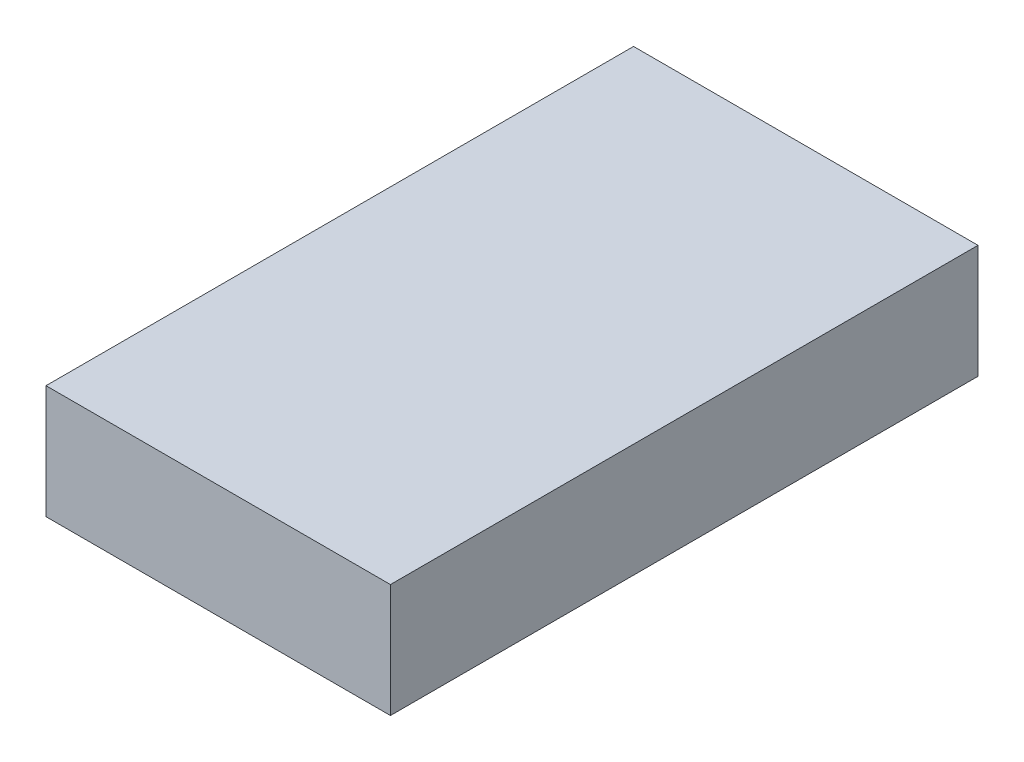
ISO-10303-21;
HEADER;
FILE_DESCRIPTION(('STEP AP214'),'2;1');
FILE_NAME('part.step','',(''),(''),'','','');
FILE_SCHEMA(('AUTOMOTIVE_DESIGN { 1 0 10303 214 1 1 1 1 }'));
ENDSEC;
DATA;
#1=APPLICATION_CONTEXT('core data for automotive mechanical design processes');
#2=APPLICATION_PROTOCOL_DEFINITION('international standard','automotive_design',2000,#1);
#3=PRODUCT_CONTEXT('',#1,'mechanical');
#4=PRODUCT('Part','Part','',(#3));
#5=PRODUCT_RELATED_PRODUCT_CATEGORY('part','',(#4));
#6=PRODUCT_DEFINITION_FORMATION('','',#4);
#7=PRODUCT_DEFINITION_CONTEXT('part definition',#1,'design');
#8=PRODUCT_DEFINITION('design','',#6,#7);
#9=PRODUCT_DEFINITION_SHAPE('','',#8);
#10=(LENGTH_UNIT() NAMED_UNIT(*) SI_UNIT(.MILLI.,.METRE.));
#11=(NAMED_UNIT(*) PLANE_ANGLE_UNIT() SI_UNIT($,.RADIAN.));
#12=(NAMED_UNIT(*) SI_UNIT($,.STERADIAN.) SOLID_ANGLE_UNIT());
#13=UNCERTAINTY_MEASURE_WITH_UNIT(LENGTH_MEASURE(1.E-05),#10,'distance_accuracy_value','');
#14=(GEOMETRIC_REPRESENTATION_CONTEXT(3) GLOBAL_UNCERTAINTY_ASSIGNED_CONTEXT((#13)) GLOBAL_UNIT_ASSIGNED_CONTEXT((#10,
#11,#12)) REPRESENTATION_CONTEXT('',''));
#15=CARTESIAN_POINT('',(0.,0.,0.));
#16=DIRECTION('',(0.,0.,1.));
#17=DIRECTION('',(1.,0.,0.));
#18=AXIS2_PLACEMENT_3D('',#15,#16,#17);
#19=CARTESIAN_POINT('',(42.5,28.,72.5));
#20=DIRECTION('',(-1.,0.,0.));
#21=DIRECTION('',(0.,0.,1.));
#22=AXIS2_PLACEMENT_3D('',#19,#20,#21);
#23=PLANE('',#22);
#24=DIRECTION('',(0.,0.,-1.));
#25=VECTOR('',#24,1.);
#26=CARTESIAN_POINT('',(42.5,0.,72.5));
#27=LINE('',#26,#25);
#28=CARTESIAN_POINT('',(42.5,0.,72.5));
#29=VERTEX_POINT('',#28);
#30=CARTESIAN_POINT('',(42.5,0.,-72.5));
#31=VERTEX_POINT('',#30);
#32=EDGE_CURVE('E96',#29,#31,#27,.T.);
#33=ORIENTED_EDGE('',*,*,#32,.T.);
#34=DIRECTION('',(0.,-1.,0.));
#35=VECTOR('',#34,1.);
#36=CARTESIAN_POINT('',(42.5,28.,-72.5));
#37=LINE('',#36,#35);
#38=CARTESIAN_POINT('',(42.5,28.,-72.5));
#39=VERTEX_POINT('',#38);
#40=EDGE_CURVE('E11',#39,#31,#37,.T.);
#41=ORIENTED_EDGE('',*,*,#40,.F.);
#42=DIRECTION('',(0.,0.,-1.));
#43=VECTOR('',#42,1.);
#44=CARTESIAN_POINT('',(42.5,28.,72.5));
#45=LINE('',#44,#43);
#46=CARTESIAN_POINT('',(42.5,28.,72.5));
#47=VERTEX_POINT('',#46);
#48=EDGE_CURVE('E84',#47,#39,#45,.T.);
#49=ORIENTED_EDGE('',*,*,#48,.F.);
#50=DIRECTION('',(0.,-1.,0.));
#51=VECTOR('',#50,1.);
#52=CARTESIAN_POINT('',(42.5,28.,72.5));
#53=LINE('',#52,#51);
#54=EDGE_CURVE('E92',#47,#29,#53,.T.);
#55=ORIENTED_EDGE('',*,*,#54,.T.);
#56=EDGE_LOOP('',(#33,#41,#49,#55));
#57=FACE_BOUND('',#56,.T.);
#58=ADVANCED_FACE('F33',(#57),#23,.F.);
#59=CARTESIAN_POINT('',(-42.5,28.,-72.5));
#60=DIRECTION('',(0.,0.,1.));
#61=DIRECTION('',(1.,0.,0.));
#62=AXIS2_PLACEMENT_3D('',#59,#60,#61);
#63=PLANE('',#62);
#64=DIRECTION('',(-1.,0.,0.));
#65=VECTOR('',#64,1.);
#66=CARTESIAN_POINT('',(-42.5,0.,-72.5));
#67=LINE('',#66,#65);
#68=CARTESIAN_POINT('',(-42.5,0.,-72.5));
#69=VERTEX_POINT('',#68);
#70=EDGE_CURVE('E88',#31,#69,#67,.T.);
#71=ORIENTED_EDGE('',*,*,#70,.T.);
#72=DIRECTION('',(0.,-1.,0.));
#73=VECTOR('',#72,1.);
#74=CARTESIAN_POINT('',(-42.5,28.,-72.5));
#75=LINE('',#74,#73);
#76=CARTESIAN_POINT('',(-42.5,28.,-72.5));
#77=VERTEX_POINT('',#76);
#78=EDGE_CURVE('E41',#77,#69,#75,.T.);
#79=ORIENTED_EDGE('',*,*,#78,.F.);
#80=DIRECTION('',(-1.,0.,0.));
#81=VECTOR('',#80,1.);
#82=CARTESIAN_POINT('',(-42.5,28.,-72.5));
#83=LINE('',#82,#81);
#84=EDGE_CURVE('E79',#39,#77,#83,.T.);
#85=ORIENTED_EDGE('',*,*,#84,.F.);
#86=ORIENTED_EDGE('',*,*,#40,.T.);
#87=EDGE_LOOP('',(#71,#79,#85,#86));
#88=FACE_BOUND('',#87,.T.);
#89=ADVANCED_FACE('F87',(#88),#63,.F.);
#90=CARTESIAN_POINT('',(-42.5,28.,72.5));
#91=DIRECTION('',(1.,0.,0.));
#92=DIRECTION('',(0.,0.,-1.));
#93=AXIS2_PLACEMENT_3D('',#90,#91,#92);
#94=PLANE('',#93);
#95=DIRECTION('',(0.,0.,1.));
#96=VECTOR('',#95,1.);
#97=CARTESIAN_POINT('',(-42.5,0.,72.5));
#98=LINE('',#97,#96);
#99=CARTESIAN_POINT('',(-42.5,0.,72.5));
#100=VERTEX_POINT('',#99);
#101=EDGE_CURVE('E66',#69,#100,#98,.T.);
#102=ORIENTED_EDGE('',*,*,#101,.T.);
#103=DIRECTION('',(0.,-1.,0.));
#104=VECTOR('',#103,1.);
#105=CARTESIAN_POINT('',(-42.5,28.,72.5));
#106=LINE('',#105,#104);
#107=CARTESIAN_POINT('',(-42.5,28.,72.5));
#108=VERTEX_POINT('',#107);
#109=EDGE_CURVE('E89',#108,#100,#106,.T.);
#110=ORIENTED_EDGE('',*,*,#109,.F.);
#111=DIRECTION('',(0.,0.,1.));
#112=VECTOR('',#111,1.);
#113=CARTESIAN_POINT('',(-42.5,28.,72.5));
#114=LINE('',#113,#112);
#115=EDGE_CURVE('E82',#77,#108,#114,.T.);
#116=ORIENTED_EDGE('',*,*,#115,.F.);
#117=ORIENTED_EDGE('',*,*,#78,.T.);
#118=EDGE_LOOP('',(#102,#110,#116,#117));
#119=FACE_BOUND('',#118,.T.);
#120=ADVANCED_FACE('F90',(#119),#94,.F.);
#121=CARTESIAN_POINT('',(-42.5,28.,72.5));
#122=DIRECTION('',(0.,0.,-1.));
#123=DIRECTION('',(-1.,0.,0.));
#124=AXIS2_PLACEMENT_3D('',#121,#122,#123);
#125=PLANE('',#124);
#126=DIRECTION('',(1.,0.,0.));
#127=VECTOR('',#126,1.);
#128=CARTESIAN_POINT('',(-42.5,0.,72.5));
#129=LINE('',#128,#127);
#130=EDGE_CURVE('E72',#100,#29,#129,.T.);
#131=ORIENTED_EDGE('',*,*,#130,.T.);
#132=ORIENTED_EDGE('',*,*,#54,.F.);
#133=DIRECTION('',(1.,0.,0.));
#134=VECTOR('',#133,1.);
#135=CARTESIAN_POINT('',(-42.5,28.,72.5));
#136=LINE('',#135,#134);
#137=EDGE_CURVE('E49',#108,#47,#136,.T.);
#138=ORIENTED_EDGE('',*,*,#137,.F.);
#139=ORIENTED_EDGE('',*,*,#109,.T.);
#140=EDGE_LOOP('',(#131,#132,#138,#139));
#141=FACE_BOUND('',#140,.T.);
#142=ADVANCED_FACE('F103',(#141),#125,.F.);
#143=CARTESIAN_POINT('',(0.,28.,0.));
#144=DIRECTION('',(0.,-1.,0.));
#145=DIRECTION('',(0.,0.,-1.));
#146=AXIS2_PLACEMENT_3D('',#143,#144,#145);
#147=PLANE('',#146);
#148=ORIENTED_EDGE('',*,*,#48,.T.);
#149=ORIENTED_EDGE('',*,*,#84,.T.);
#150=ORIENTED_EDGE('',*,*,#115,.T.);
#151=ORIENTED_EDGE('',*,*,#137,.T.);
#152=EDGE_LOOP('',(#148,#149,#150,#151));
#153=FACE_BOUND('',#152,.T.);
#154=ADVANCED_FACE('F80',(#153),#147,.F.);
#155=CARTESIAN_POINT('',(0.,0.,0.));
#156=DIRECTION('',(0.,-1.,0.));
#157=DIRECTION('',(0.,0.,-1.));
#158=AXIS2_PLACEMENT_3D('',#155,#156,#157);
#159=PLANE('',#158);
#160=ORIENTED_EDGE('',*,*,#32,.F.);
#161=ORIENTED_EDGE('',*,*,#130,.F.);
#162=ORIENTED_EDGE('',*,*,#101,.F.);
#163=ORIENTED_EDGE('',*,*,#70,.F.);
#164=EDGE_LOOP('',(#160,#161,#162,#163));
#165=FACE_BOUND('',#164,.T.);
#166=ADVANCED_FACE('F106',(#165),#159,.T.);
#167=CLOSED_SHELL('',(#58,#89,#120,#142,#154,#166));
#168=MANIFOLD_SOLID_BREP('B2',#167);
#169=ADVANCED_BREP_SHAPE_REPRESENTATION('',(#18,#168),#14);
#170=SHAPE_DEFINITION_REPRESENTATION(#9,#169);
ENDSEC;
END-ISO-10303-21;
